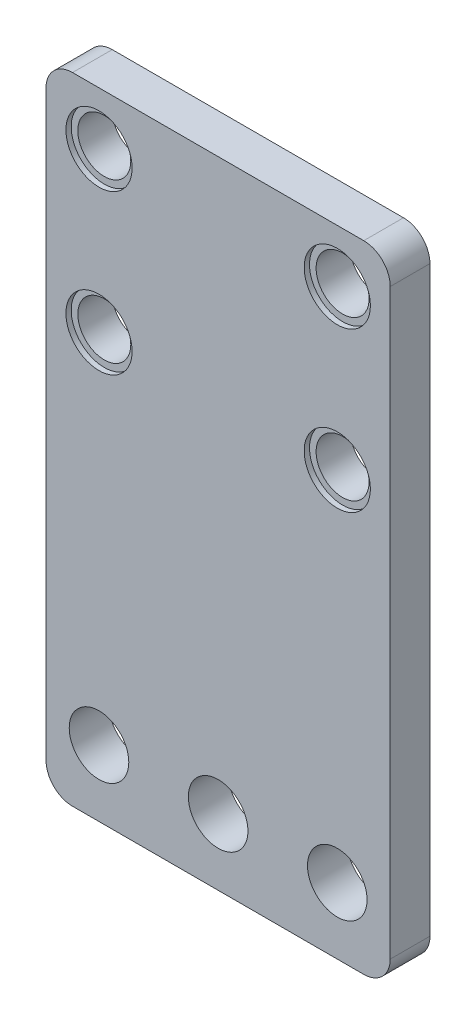
ISO-10303-21;
HEADER;
FILE_DESCRIPTION(('STEP AP214'),'2;1');
FILE_NAME('part.step','',(''),(''),'','','');
FILE_SCHEMA(('AUTOMOTIVE_DESIGN { 1 0 10303 214 1 1 1 1 }'));
ENDSEC;
DATA;
#1=APPLICATION_CONTEXT('core data for automotive mechanical design processes');
#2=APPLICATION_PROTOCOL_DEFINITION('international standard','automotive_design',2000,#1);
#3=PRODUCT_CONTEXT('',#1,'mechanical');
#4=PRODUCT('Part','Part','',(#3));
#5=PRODUCT_RELATED_PRODUCT_CATEGORY('part','',(#4));
#6=PRODUCT_DEFINITION_FORMATION('','',#4);
#7=PRODUCT_DEFINITION_CONTEXT('part definition',#1,'design');
#8=PRODUCT_DEFINITION('design','',#6,#7);
#9=PRODUCT_DEFINITION_SHAPE('','',#8);
#10=(LENGTH_UNIT() NAMED_UNIT(*) SI_UNIT(.MILLI.,.METRE.));
#11=(NAMED_UNIT(*) PLANE_ANGLE_UNIT() SI_UNIT($,.RADIAN.));
#12=(NAMED_UNIT(*) SI_UNIT($,.STERADIAN.) SOLID_ANGLE_UNIT());
#13=UNCERTAINTY_MEASURE_WITH_UNIT(LENGTH_MEASURE(1.E-05),#10,'distance_accuracy_value','');
#14=(GEOMETRIC_REPRESENTATION_CONTEXT(3) GLOBAL_UNCERTAINTY_ASSIGNED_CONTEXT((#13)) GLOBAL_UNIT_ASSIGNED_CONTEXT((#10,
#11,#12)) REPRESENTATION_CONTEXT('',''));
#15=CARTESIAN_POINT('',(0.,0.,0.));
#16=DIRECTION('',(0.,0.,1.));
#17=DIRECTION('',(1.,0.,0.));
#18=AXIS2_PLACEMENT_3D('',#15,#16,#17);
#19=CARTESIAN_POINT('',(4.,44.,0.));
#20=DIRECTION('',(0.,0.,1.));
#21=DIRECTION('',(1.,0.,0.));
#22=AXIS2_PLACEMENT_3D('',#19,#20,#21);
#23=CYLINDRICAL_SURFACE('',#22,2.);
#24=CARTESIAN_POINT('',(4.,44.,0.));
#25=DIRECTION('',(0.,0.,1.));
#26=DIRECTION('',(1.,0.,0.));
#27=AXIS2_PLACEMENT_3D('',#24,#25,#26);
#28=CIRCLE('',#27,2.);
#29=CARTESIAN_POINT('',(6.,44.,0.));
#30=VERTEX_POINT('',#29);
#31=EDGE_CURVE('E126',#30,#30,#28,.T.);
#32=ORIENTED_EDGE('',*,*,#31,.F.);
#33=EDGE_LOOP('',(#32));
#34=FACE_BOUND('',#33,.T.);
#35=CARTESIAN_POINT('',(4.,44.,2.6));
#36=DIRECTION('',(0.,0.,1.));
#37=DIRECTION('',(1.,0.,0.));
#38=AXIS2_PLACEMENT_3D('',#35,#36,#37);
#39=CIRCLE('',#38,2.);
#40=CARTESIAN_POINT('',(6.,44.,2.6));
#41=VERTEX_POINT('',#40);
#42=EDGE_CURVE('E153',#41,#41,#39,.F.);
#43=ORIENTED_EDGE('',*,*,#42,.F.);
#44=EDGE_LOOP('',(#43));
#45=FACE_BOUND('',#44,.T.);
#46=ADVANCED_FACE('F33',(#34,#45),#23,.F.);
#47=CARTESIAN_POINT('',(22.,44.,0.));
#48=DIRECTION('',(0.,0.,1.));
#49=DIRECTION('',(1.,0.,0.));
#50=AXIS2_PLACEMENT_3D('',#47,#48,#49);
#51=CYLINDRICAL_SURFACE('',#50,2.);
#52=CARTESIAN_POINT('',(22.,44.,0.));
#53=DIRECTION('',(0.,0.,1.));
#54=DIRECTION('',(-1.,0.,0.));
#55=AXIS2_PLACEMENT_3D('',#52,#53,#54);
#56=CIRCLE('',#55,2.);
#57=CARTESIAN_POINT('',(20.,44.,0.));
#58=VERTEX_POINT('',#57);
#59=EDGE_CURVE('E195',#58,#58,#56,.T.);
#60=ORIENTED_EDGE('',*,*,#59,.F.);
#61=EDGE_LOOP('',(#60));
#62=FACE_BOUND('',#61,.T.);
#63=CARTESIAN_POINT('',(22.,44.,2.6));
#64=DIRECTION('',(0.,0.,1.));
#65=DIRECTION('',(1.,0.,0.));
#66=AXIS2_PLACEMENT_3D('',#63,#64,#65);
#67=CIRCLE('',#66,2.);
#68=CARTESIAN_POINT('',(24.,44.,2.6));
#69=VERTEX_POINT('',#68);
#70=EDGE_CURVE('E149',#69,#69,#67,.F.);
#71=ORIENTED_EDGE('',*,*,#70,.F.);
#72=EDGE_LOOP('',(#71));
#73=FACE_BOUND('',#72,.T.);
#74=ADVANCED_FACE('F282',(#62,#73),#51,.F.);
#75=CARTESIAN_POINT('',(22.,32.,0.));
#76=DIRECTION('',(0.,0.,1.));
#77=DIRECTION('',(1.,0.,0.));
#78=AXIS2_PLACEMENT_3D('',#75,#76,#77);
#79=CYLINDRICAL_SURFACE('',#78,2.);
#80=CARTESIAN_POINT('',(22.,32.,0.));
#81=DIRECTION('',(0.,0.,1.));
#82=DIRECTION('',(1.,0.,0.));
#83=AXIS2_PLACEMENT_3D('',#80,#81,#82);
#84=CIRCLE('',#83,2.);
#85=CARTESIAN_POINT('',(24.,32.,0.));
#86=VERTEX_POINT('',#85);
#87=EDGE_CURVE('E198',#86,#86,#84,.T.);
#88=ORIENTED_EDGE('',*,*,#87,.F.);
#89=EDGE_LOOP('',(#88));
#90=FACE_BOUND('',#89,.T.);
#91=CARTESIAN_POINT('',(22.,32.,2.6));
#92=DIRECTION('',(0.,0.,1.));
#93=DIRECTION('',(1.,0.,0.));
#94=AXIS2_PLACEMENT_3D('',#91,#92,#93);
#95=CIRCLE('',#94,2.);
#96=CARTESIAN_POINT('',(24.,32.,2.6));
#97=VERTEX_POINT('',#96);
#98=EDGE_CURVE('E146',#97,#97,#95,.F.);
#99=ORIENTED_EDGE('',*,*,#98,.F.);
#100=EDGE_LOOP('',(#99));
#101=FACE_BOUND('',#100,.T.);
#102=ADVANCED_FACE('F288',(#90,#101),#79,.F.);
#103=CARTESIAN_POINT('',(4.,32.,0.));
#104=DIRECTION('',(0.,0.,1.));
#105=DIRECTION('',(1.,0.,0.));
#106=AXIS2_PLACEMENT_3D('',#103,#104,#105);
#107=CYLINDRICAL_SURFACE('',#106,2.);
#108=CARTESIAN_POINT('',(4.,32.,0.));
#109=DIRECTION('',(0.,0.,1.));
#110=DIRECTION('',(-1.,0.,0.));
#111=AXIS2_PLACEMENT_3D('',#108,#109,#110);
#112=CIRCLE('',#111,2.);
#113=CARTESIAN_POINT('',(2.,32.,0.));
#114=VERTEX_POINT('',#113);
#115=EDGE_CURVE('E132',#114,#114,#112,.T.);
#116=ORIENTED_EDGE('',*,*,#115,.F.);
#117=EDGE_LOOP('',(#116));
#118=FACE_BOUND('',#117,.T.);
#119=CARTESIAN_POINT('',(4.,32.,2.6));
#120=DIRECTION('',(0.,0.,1.));
#121=DIRECTION('',(1.,0.,0.));
#122=AXIS2_PLACEMENT_3D('',#119,#120,#121);
#123=CIRCLE('',#122,2.);
#124=CARTESIAN_POINT('',(6.,32.,2.6));
#125=VERTEX_POINT('',#124);
#126=EDGE_CURVE('E141',#125,#125,#123,.F.);
#127=ORIENTED_EDGE('',*,*,#126,.F.);
#128=EDGE_LOOP('',(#127));
#129=FACE_BOUND('',#128,.T.);
#130=ADVANCED_FACE('F306',(#118,#129),#107,.F.);
#131=CARTESIAN_POINT('',(0.,0.,3.));
#132=DIRECTION('',(1.,0.,0.));
#133=DIRECTION('',(0.,0.,-1.));
#134=AXIS2_PLACEMENT_3D('',#131,#132,#133);
#135=PLANE('',#134);
#136=DIRECTION('',(0.,-1.,0.));
#137=VECTOR('',#136,1.);
#138=CARTESIAN_POINT('',(0.,0.,3.));
#139=LINE('',#138,#137);
#140=CARTESIAN_POINT('',(0.,46.,3.));
#141=VERTEX_POINT('',#140);
#142=CARTESIAN_POINT('',(0.,2.,3.));
#143=VERTEX_POINT('',#142);
#144=EDGE_CURVE('E119',#141,#143,#139,.T.);
#145=ORIENTED_EDGE('',*,*,#144,.F.);
#146=DIRECTION('',(0.,0.,-1.));
#147=VECTOR('',#146,1.);
#148=CARTESIAN_POINT('',(0.,46.,3.));
#149=LINE('',#148,#147);
#150=CARTESIAN_POINT('',(0.,46.,0.));
#151=VERTEX_POINT('',#150);
#152=EDGE_CURVE('E103',#141,#151,#149,.T.);
#153=ORIENTED_EDGE('',*,*,#152,.T.);
#154=DIRECTION('',(0.,-1.,0.));
#155=VECTOR('',#154,1.);
#156=CARTESIAN_POINT('',(0.,0.,0.));
#157=LINE('',#156,#155);
#158=CARTESIAN_POINT('',(0.,2.,0.));
#159=VERTEX_POINT('',#158);
#160=EDGE_CURVE('E116',#151,#159,#157,.T.);
#161=ORIENTED_EDGE('',*,*,#160,.T.);
#162=DIRECTION('',(0.,0.,-1.));
#163=VECTOR('',#162,1.);
#164=CARTESIAN_POINT('',(0.,2.,3.));
#165=LINE('',#164,#163);
#166=EDGE_CURVE('E121',#159,#143,#165,.F.);
#167=ORIENTED_EDGE('',*,*,#166,.T.);
#168=EDGE_LOOP('',(#145,#153,#161,#167));
#169=FACE_BOUND('',#168,.T.);
#170=ADVANCED_FACE('F115',(#169),#135,.F.);
#171=CARTESIAN_POINT('',(0.,0.,3.));
#172=DIRECTION('',(0.,1.,0.));
#173=DIRECTION('',(0.,0.,1.));
#174=AXIS2_PLACEMENT_3D('',#171,#172,#173);
#175=PLANE('',#174);
#176=DIRECTION('',(1.,0.,0.));
#177=VECTOR('',#176,1.);
#178=CARTESIAN_POINT('',(0.,0.,0.));
#179=LINE('',#178,#177);
#180=CARTESIAN_POINT('',(2.,0.,0.));
#181=VERTEX_POINT('',#180);
#182=CARTESIAN_POINT('',(24.,0.,0.));
#183=VERTEX_POINT('',#182);
#184=EDGE_CURVE('E125',#181,#183,#179,.T.);
#185=ORIENTED_EDGE('',*,*,#184,.T.);
#186=DIRECTION('',(0.,0.,-1.));
#187=VECTOR('',#186,1.);
#188=CARTESIAN_POINT('',(24.,0.,3.));
#189=LINE('',#188,#187);
#190=CARTESIAN_POINT('',(24.,0.,3.));
#191=VERTEX_POINT('',#190);
#192=EDGE_CURVE('E11',#183,#191,#189,.F.);
#193=ORIENTED_EDGE('',*,*,#192,.T.);
#194=DIRECTION('',(1.,0.,0.));
#195=VECTOR('',#194,1.);
#196=CARTESIAN_POINT('',(0.,0.,3.));
#197=LINE('',#196,#195);
#198=CARTESIAN_POINT('',(2.,0.,3.));
#199=VERTEX_POINT('',#198);
#200=EDGE_CURVE('E181',#199,#191,#197,.T.);
#201=ORIENTED_EDGE('',*,*,#200,.F.);
#202=DIRECTION('',(0.,0.,-1.));
#203=VECTOR('',#202,1.);
#204=CARTESIAN_POINT('',(2.,0.,3.));
#205=LINE('',#204,#203);
#206=EDGE_CURVE('E41',#199,#181,#205,.T.);
#207=ORIENTED_EDGE('',*,*,#206,.T.);
#208=EDGE_LOOP('',(#185,#193,#201,#207));
#209=FACE_BOUND('',#208,.T.);
#210=ADVANCED_FACE('F179',(#209),#175,.F.);
#211=CARTESIAN_POINT('',(26.,0.,3.));
#212=DIRECTION('',(-1.,0.,0.));
#213=DIRECTION('',(0.,0.,1.));
#214=AXIS2_PLACEMENT_3D('',#211,#212,#213);
#215=PLANE('',#214);
#216=DIRECTION('',(0.,1.,0.));
#217=VECTOR('',#216,1.);
#218=CARTESIAN_POINT('',(26.,0.,0.));
#219=LINE('',#218,#217);
#220=CARTESIAN_POINT('',(26.,2.,0.));
#221=VERTEX_POINT('',#220);
#222=CARTESIAN_POINT('',(26.,46.,0.));
#223=VERTEX_POINT('',#222);
#224=EDGE_CURVE('E129',#221,#223,#219,.T.);
#225=ORIENTED_EDGE('',*,*,#224,.T.);
#226=DIRECTION('',(0.,0.,-1.));
#227=VECTOR('',#226,1.);
#228=CARTESIAN_POINT('',(26.,46.,3.));
#229=LINE('',#228,#227);
#230=CARTESIAN_POINT('',(26.,46.,3.));
#231=VERTEX_POINT('',#230);
#232=EDGE_CURVE('E48',#223,#231,#229,.F.);
#233=ORIENTED_EDGE('',*,*,#232,.T.);
#234=DIRECTION('',(0.,1.,0.));
#235=VECTOR('',#234,1.);
#236=CARTESIAN_POINT('',(26.,0.,3.));
#237=LINE('',#236,#235);
#238=CARTESIAN_POINT('',(26.,2.,3.));
#239=VERTEX_POINT('',#238);
#240=EDGE_CURVE('E189',#239,#231,#237,.T.);
#241=ORIENTED_EDGE('',*,*,#240,.F.);
#242=DIRECTION('',(0.,0.,-1.));
#243=VECTOR('',#242,1.);
#244=CARTESIAN_POINT('',(26.,2.,3.));
#245=LINE('',#244,#243);
#246=EDGE_CURVE('E172',#239,#221,#245,.T.);
#247=ORIENTED_EDGE('',*,*,#246,.T.);
#248=EDGE_LOOP('',(#225,#233,#241,#247));
#249=FACE_BOUND('',#248,.T.);
#250=ADVANCED_FACE('F188',(#249),#215,.F.);
#251=CARTESIAN_POINT('',(0.,48.,3.));
#252=DIRECTION('',(0.,-1.,0.));
#253=DIRECTION('',(0.,0.,-1.));
#254=AXIS2_PLACEMENT_3D('',#251,#252,#253);
#255=PLANE('',#254);
#256=DIRECTION('',(-1.,0.,0.));
#257=VECTOR('',#256,1.);
#258=CARTESIAN_POINT('',(0.,48.,0.));
#259=LINE('',#258,#257);
#260=CARTESIAN_POINT('',(24.,48.,0.));
#261=VERTEX_POINT('',#260);
#262=CARTESIAN_POINT('',(2.,48.,0.));
#263=VERTEX_POINT('',#262);
#264=EDGE_CURVE('E139',#261,#263,#259,.T.);
#265=ORIENTED_EDGE('',*,*,#264,.T.);
#266=DIRECTION('',(0.,0.,-1.));
#267=VECTOR('',#266,1.);
#268=CARTESIAN_POINT('',(2.,48.,3.));
#269=LINE('',#268,#267);
#270=CARTESIAN_POINT('',(2.,48.,3.));
#271=VERTEX_POINT('',#270);
#272=EDGE_CURVE('E104',#263,#271,#269,.F.);
#273=ORIENTED_EDGE('',*,*,#272,.T.);
#274=DIRECTION('',(-1.,0.,0.));
#275=VECTOR('',#274,1.);
#276=CARTESIAN_POINT('',(0.,48.,3.));
#277=LINE('',#276,#275);
#278=CARTESIAN_POINT('',(24.,48.,3.));
#279=VERTEX_POINT('',#278);
#280=EDGE_CURVE('E135',#279,#271,#277,.T.);
#281=ORIENTED_EDGE('',*,*,#280,.F.);
#282=DIRECTION('',(0.,0.,-1.));
#283=VECTOR('',#282,1.);
#284=CARTESIAN_POINT('',(24.,48.,3.));
#285=LINE('',#284,#283);
#286=EDGE_CURVE('E109',#279,#261,#285,.T.);
#287=ORIENTED_EDGE('',*,*,#286,.T.);
#288=EDGE_LOOP('',(#265,#273,#281,#287));
#289=FACE_BOUND('',#288,.T.);
#290=ADVANCED_FACE('F255',(#289),#255,.F.);
#291=CARTESIAN_POINT('',(0.,0.,3.));
#292=DIRECTION('',(0.,0.,-1.));
#293=DIRECTION('',(-1.,0.,0.));
#294=AXIS2_PLACEMENT_3D('',#291,#292,#293);
#295=PLANE('',#294);
#296=CARTESIAN_POINT('',(22.,32.,3.));
#297=DIRECTION('',(0.,0.,1.));
#298=DIRECTION('',(1.,0.,0.));
#299=AXIS2_PLACEMENT_3D('',#296,#297,#298);
#300=CIRCLE('',#299,2.5);
#301=CARTESIAN_POINT('',(24.5,32.,3.));
#302=VERTEX_POINT('',#301);
#303=EDGE_CURVE('E236',#302,#302,#300,.T.);
#304=ORIENTED_EDGE('',*,*,#303,.F.);
#305=EDGE_LOOP('',(#304));
#306=FACE_BOUND('',#305,.T.);
#307=CARTESIAN_POINT('',(22.,44.,3.));
#308=DIRECTION('',(0.,0.,1.));
#309=DIRECTION('',(1.,0.,0.));
#310=AXIS2_PLACEMENT_3D('',#307,#308,#309);
#311=CIRCLE('',#310,2.5);
#312=CARTESIAN_POINT('',(24.5,44.,3.));
#313=VERTEX_POINT('',#312);
#314=EDGE_CURVE('E230',#313,#313,#311,.T.);
#315=ORIENTED_EDGE('',*,*,#314,.F.);
#316=EDGE_LOOP('',(#315));
#317=FACE_BOUND('',#316,.T.);
#318=CARTESIAN_POINT('',(4.,44.,3.));
#319=DIRECTION('',(0.,0.,1.));
#320=DIRECTION('',(1.,0.,0.));
#321=AXIS2_PLACEMENT_3D('',#318,#319,#320);
#322=CIRCLE('',#321,2.5);
#323=CARTESIAN_POINT('',(6.5,44.,3.));
#324=VERTEX_POINT('',#323);
#325=EDGE_CURVE('E224',#324,#324,#322,.T.);
#326=ORIENTED_EDGE('',*,*,#325,.F.);
#327=EDGE_LOOP('',(#326));
#328=FACE_BOUND('',#327,.T.);
#329=CARTESIAN_POINT('',(4.,32.,3.));
#330=DIRECTION('',(0.,0.,1.));
#331=DIRECTION('',(1.,0.,0.));
#332=AXIS2_PLACEMENT_3D('',#329,#330,#331);
#333=CIRCLE('',#332,2.5);
#334=CARTESIAN_POINT('',(6.5,32.,3.));
#335=VERTEX_POINT('',#334);
#336=EDGE_CURVE('E156',#335,#335,#333,.T.);
#337=ORIENTED_EDGE('',*,*,#336,.F.);
#338=EDGE_LOOP('',(#337));
#339=FACE_BOUND('',#338,.T.);
#340=CARTESIAN_POINT('',(4.,5.,3.));
#341=DIRECTION('',(0.,0.,-1.));
#342=DIRECTION('',(-1.,0.,0.));
#343=AXIS2_PLACEMENT_3D('',#340,#341,#342);
#344=CIRCLE('',#343,2.25);
#345=CARTESIAN_POINT('',(1.75,5.,3.));
#346=VERTEX_POINT('',#345);
#347=EDGE_CURVE('E209',#346,#346,#344,.T.);
#348=ORIENTED_EDGE('',*,*,#347,.T.);
#349=EDGE_LOOP('',(#348));
#350=FACE_BOUND('',#349,.T.);
#351=CARTESIAN_POINT('',(22.,5.,3.));
#352=DIRECTION('',(0.,0.,-1.));
#353=DIRECTION('',(-1.,0.,0.));
#354=AXIS2_PLACEMENT_3D('',#351,#352,#353);
#355=CIRCLE('',#354,2.25);
#356=CARTESIAN_POINT('',(19.75,5.,3.));
#357=VERTEX_POINT('',#356);
#358=EDGE_CURVE('E212',#357,#357,#355,.T.);
#359=ORIENTED_EDGE('',*,*,#358,.T.);
#360=EDGE_LOOP('',(#359));
#361=FACE_BOUND('',#360,.T.);
#362=CARTESIAN_POINT('',(13.,5.,3.));
#363=DIRECTION('',(0.,0.,-1.));
#364=DIRECTION('',(-1.,0.,0.));
#365=AXIS2_PLACEMENT_3D('',#362,#363,#364);
#366=CIRCLE('',#365,2.25);
#367=CARTESIAN_POINT('',(10.75,5.,3.));
#368=VERTEX_POINT('',#367);
#369=EDGE_CURVE('E199',#368,#368,#366,.T.);
#370=ORIENTED_EDGE('',*,*,#369,.T.);
#371=EDGE_LOOP('',(#370));
#372=FACE_BOUND('',#371,.T.);
#373=ORIENTED_EDGE('',*,*,#280,.T.);
#374=CARTESIAN_POINT('',(2.,46.,3.));
#375=DIRECTION('',(0.,0.,-1.));
#376=DIRECTION('',(-1.,0.,0.));
#377=AXIS2_PLACEMENT_3D('',#374,#375,#376);
#378=CIRCLE('',#377,2.);
#379=EDGE_CURVE('E170',#271,#141,#378,.F.);
#380=ORIENTED_EDGE('',*,*,#379,.T.);
#381=ORIENTED_EDGE('',*,*,#144,.T.);
#382=CARTESIAN_POINT('',(2.,2.,3.));
#383=DIRECTION('',(0.,0.,-1.));
#384=DIRECTION('',(-1.,0.,0.));
#385=AXIS2_PLACEMENT_3D('',#382,#383,#384);
#386=CIRCLE('',#385,2.);
#387=EDGE_CURVE('E165',#143,#199,#386,.F.);
#388=ORIENTED_EDGE('',*,*,#387,.T.);
#389=ORIENTED_EDGE('',*,*,#200,.T.);
#390=CARTESIAN_POINT('',(24.,2.,3.));
#391=DIRECTION('',(0.,0.,-1.));
#392=DIRECTION('',(-1.,0.,0.));
#393=AXIS2_PLACEMENT_3D('',#390,#391,#392);
#394=CIRCLE('',#393,2.);
#395=EDGE_CURVE('E55',#191,#239,#394,.F.);
#396=ORIENTED_EDGE('',*,*,#395,.T.);
#397=ORIENTED_EDGE('',*,*,#240,.T.);
#398=CARTESIAN_POINT('',(24.,46.,3.));
#399=DIRECTION('',(0.,0.,-1.));
#400=DIRECTION('',(-1.,0.,0.));
#401=AXIS2_PLACEMENT_3D('',#398,#399,#400);
#402=CIRCLE('',#401,2.);
#403=EDGE_CURVE('E168',#231,#279,#402,.F.);
#404=ORIENTED_EDGE('',*,*,#403,.T.);
#405=EDGE_LOOP('',(#373,#380,#381,#388,#389,#396,#397,#404));
#406=FACE_BOUND('',#405,.T.);
#407=ADVANCED_FACE('F252',(#306,#317,#328,#339,#350,#361,#372,#406),#295,.F.);
#408=CARTESIAN_POINT('',(0.,0.,0.));
#409=DIRECTION('',(0.,0.,-1.));
#410=DIRECTION('',(-1.,0.,0.));
#411=AXIS2_PLACEMENT_3D('',#408,#409,#410);
#412=PLANE('',#411);
#413=CARTESIAN_POINT('',(4.,5.,0.));
#414=DIRECTION('',(0.,0.,1.));
#415=DIRECTION('',(1.,0.,0.));
#416=AXIS2_PLACEMENT_3D('',#413,#414,#415);
#417=CIRCLE('',#416,2.25);
#418=CARTESIAN_POINT('',(6.25,5.,0.));
#419=VERTEX_POINT('',#418);
#420=EDGE_CURVE('E215',#419,#419,#417,.T.);
#421=ORIENTED_EDGE('',*,*,#420,.T.);
#422=EDGE_LOOP('',(#421));
#423=FACE_BOUND('',#422,.T.);
#424=CARTESIAN_POINT('',(22.,5.,0.));
#425=DIRECTION('',(0.,0.,1.));
#426=DIRECTION('',(-1.,0.,0.));
#427=AXIS2_PLACEMENT_3D('',#424,#425,#426);
#428=CIRCLE('',#427,2.25);
#429=CARTESIAN_POINT('',(19.75,5.,0.));
#430=VERTEX_POINT('',#429);
#431=EDGE_CURVE('E144',#430,#430,#428,.T.);
#432=ORIENTED_EDGE('',*,*,#431,.T.);
#433=EDGE_LOOP('',(#432));
#434=FACE_BOUND('',#433,.T.);
#435=CARTESIAN_POINT('',(13.,5.,0.));
#436=DIRECTION('',(0.,0.,1.));
#437=DIRECTION('',(1.,0.,0.));
#438=AXIS2_PLACEMENT_3D('',#435,#436,#437);
#439=CIRCLE('',#438,2.25);
#440=CARTESIAN_POINT('',(15.25,5.,0.));
#441=VERTEX_POINT('',#440);
#442=EDGE_CURVE('E206',#441,#441,#439,.T.);
#443=ORIENTED_EDGE('',*,*,#442,.T.);
#444=EDGE_LOOP('',(#443));
#445=FACE_BOUND('',#444,.T.);
#446=ORIENTED_EDGE('',*,*,#115,.T.);
#447=EDGE_LOOP('',(#446));
#448=FACE_BOUND('',#447,.T.);
#449=ORIENTED_EDGE('',*,*,#87,.T.);
#450=EDGE_LOOP('',(#449));
#451=FACE_BOUND('',#450,.T.);
#452=ORIENTED_EDGE('',*,*,#59,.T.);
#453=EDGE_LOOP('',(#452));
#454=FACE_BOUND('',#453,.T.);
#455=ORIENTED_EDGE('',*,*,#31,.T.);
#456=EDGE_LOOP('',(#455));
#457=FACE_BOUND('',#456,.T.);
#458=ORIENTED_EDGE('',*,*,#160,.F.);
#459=CARTESIAN_POINT('',(2.,46.,0.));
#460=DIRECTION('',(0.,0.,-1.));
#461=DIRECTION('',(-1.,0.,0.));
#462=AXIS2_PLACEMENT_3D('',#459,#460,#461);
#463=CIRCLE('',#462,2.);
#464=EDGE_CURVE('E99',#151,#263,#463,.T.);
#465=ORIENTED_EDGE('',*,*,#464,.T.);
#466=ORIENTED_EDGE('',*,*,#264,.F.);
#467=CARTESIAN_POINT('',(24.,46.,0.));
#468=DIRECTION('',(0.,0.,-1.));
#469=DIRECTION('',(-1.,0.,0.));
#470=AXIS2_PLACEMENT_3D('',#467,#468,#469);
#471=CIRCLE('',#470,2.);
#472=EDGE_CURVE('E110',#261,#223,#471,.T.);
#473=ORIENTED_EDGE('',*,*,#472,.T.);
#474=ORIENTED_EDGE('',*,*,#224,.F.);
#475=CARTESIAN_POINT('',(24.,2.,0.));
#476=DIRECTION('',(0.,0.,-1.));
#477=DIRECTION('',(-1.,0.,0.));
#478=AXIS2_PLACEMENT_3D('',#475,#476,#477);
#479=CIRCLE('',#478,2.);
#480=EDGE_CURVE('E159',#221,#183,#479,.T.);
#481=ORIENTED_EDGE('',*,*,#480,.T.);
#482=ORIENTED_EDGE('',*,*,#184,.F.);
#483=CARTESIAN_POINT('',(2.,2.,0.));
#484=DIRECTION('',(0.,0.,-1.));
#485=DIRECTION('',(-1.,0.,0.));
#486=AXIS2_PLACEMENT_3D('',#483,#484,#485);
#487=CIRCLE('',#486,2.);
#488=EDGE_CURVE('E120',#181,#159,#487,.T.);
#489=ORIENTED_EDGE('',*,*,#488,.T.);
#490=EDGE_LOOP('',(#458,#465,#466,#473,#474,#481,#482,#489));
#491=FACE_BOUND('',#490,.T.);
#492=ADVANCED_FACE('F123',(#423,#434,#445,#448,#451,#454,#457,#491),#412,.T.);
#493=CARTESIAN_POINT('',(13.,5.,0.));
#494=DIRECTION('',(0.,0.,1.));
#495=DIRECTION('',(1.,0.,0.));
#496=AXIS2_PLACEMENT_3D('',#493,#494,#495);
#497=CYLINDRICAL_SURFACE('',#496,2.25);
#498=ORIENTED_EDGE('',*,*,#442,.F.);
#499=EDGE_LOOP('',(#498));
#500=FACE_BOUND('',#499,.T.);
#501=ORIENTED_EDGE('',*,*,#369,.F.);
#502=EDGE_LOOP('',(#501));
#503=FACE_BOUND('',#502,.T.);
#504=ADVANCED_FACE('F297',(#500,#503),#497,.F.);
#505=CARTESIAN_POINT('',(22.,5.,0.));
#506=DIRECTION('',(0.,0.,1.));
#507=DIRECTION('',(1.,0.,0.));
#508=AXIS2_PLACEMENT_3D('',#505,#506,#507);
#509=CYLINDRICAL_SURFACE('',#508,2.25);
#510=ORIENTED_EDGE('',*,*,#431,.F.);
#511=EDGE_LOOP('',(#510));
#512=FACE_BOUND('',#511,.T.);
#513=ORIENTED_EDGE('',*,*,#358,.F.);
#514=EDGE_LOOP('',(#513));
#515=FACE_BOUND('',#514,.T.);
#516=ADVANCED_FACE('F322',(#512,#515),#509,.F.);
#517=CARTESIAN_POINT('',(4.,5.,0.));
#518=DIRECTION('',(0.,0.,1.));
#519=DIRECTION('',(1.,0.,0.));
#520=AXIS2_PLACEMENT_3D('',#517,#518,#519);
#521=CYLINDRICAL_SURFACE('',#520,2.25);
#522=ORIENTED_EDGE('',*,*,#420,.F.);
#523=EDGE_LOOP('',(#522));
#524=FACE_BOUND('',#523,.T.);
#525=ORIENTED_EDGE('',*,*,#347,.F.);
#526=EDGE_LOOP('',(#525));
#527=FACE_BOUND('',#526,.T.);
#528=ADVANCED_FACE('F326',(#524,#527),#521,.F.);
#529=CARTESIAN_POINT('',(4.,32.,2.6));
#530=DIRECTION('',(0.,0.,1.));
#531=DIRECTION('',(1.,0.,0.));
#532=AXIS2_PLACEMENT_3D('',#529,#530,#531);
#533=PLANE('',#532);
#534=CARTESIAN_POINT('',(4.,32.,2.6));
#535=DIRECTION('',(0.,0.,1.));
#536=DIRECTION('',(1.,0.,0.));
#537=AXIS2_PLACEMENT_3D('',#534,#535,#536);
#538=CIRCLE('',#537,2.5);
#539=CARTESIAN_POINT('',(6.5,32.,2.6));
#540=VERTEX_POINT('',#539);
#541=EDGE_CURVE('E145',#540,#540,#538,.T.);
#542=ORIENTED_EDGE('',*,*,#541,.T.);
#543=EDGE_LOOP('',(#542));
#544=FACE_BOUND('',#543,.T.);
#545=ORIENTED_EDGE('',*,*,#126,.T.);
#546=EDGE_LOOP('',(#545));
#547=FACE_BOUND('',#546,.T.);
#548=ADVANCED_FACE('F330',(#544,#547),#533,.T.);
#549=CARTESIAN_POINT('',(4.,32.,2.6));
#550=DIRECTION('',(0.,0.,1.));
#551=DIRECTION('',(1.,0.,0.));
#552=AXIS2_PLACEMENT_3D('',#549,#550,#551);
#553=CYLINDRICAL_SURFACE('',#552,2.5);
#554=ORIENTED_EDGE('',*,*,#541,.F.);
#555=EDGE_LOOP('',(#554));
#556=FACE_BOUND('',#555,.T.);
#557=ORIENTED_EDGE('',*,*,#336,.T.);
#558=EDGE_LOOP('',(#557));
#559=FACE_BOUND('',#558,.T.);
#560=ADVANCED_FACE('F332',(#556,#559),#553,.F.);
#561=CARTESIAN_POINT('',(22.,32.,2.6));
#562=DIRECTION('',(0.,0.,1.));
#563=DIRECTION('',(1.,0.,0.));
#564=AXIS2_PLACEMENT_3D('',#561,#562,#563);
#565=PLANE('',#564);
#566=CARTESIAN_POINT('',(22.,32.,2.6));
#567=DIRECTION('',(0.,0.,1.));
#568=DIRECTION('',(1.,0.,0.));
#569=AXIS2_PLACEMENT_3D('',#566,#567,#568);
#570=CIRCLE('',#569,2.5);
#571=CARTESIAN_POINT('',(24.5,32.,2.6));
#572=VERTEX_POINT('',#571);
#573=EDGE_CURVE('E150',#572,#572,#570,.T.);
#574=ORIENTED_EDGE('',*,*,#573,.T.);
#575=EDGE_LOOP('',(#574));
#576=FACE_BOUND('',#575,.T.);
#577=ORIENTED_EDGE('',*,*,#98,.T.);
#578=EDGE_LOOP('',(#577));
#579=FACE_BOUND('',#578,.T.);
#580=ADVANCED_FACE('F242',(#576,#579),#565,.T.);
#581=CARTESIAN_POINT('',(22.,32.,2.6));
#582=DIRECTION('',(0.,0.,1.));
#583=DIRECTION('',(1.,0.,0.));
#584=AXIS2_PLACEMENT_3D('',#581,#582,#583);
#585=CYLINDRICAL_SURFACE('',#584,2.5);
#586=ORIENTED_EDGE('',*,*,#573,.F.);
#587=EDGE_LOOP('',(#586));
#588=FACE_BOUND('',#587,.T.);
#589=ORIENTED_EDGE('',*,*,#303,.T.);
#590=EDGE_LOOP('',(#589));
#591=FACE_BOUND('',#590,.T.);
#592=ADVANCED_FACE('F245',(#588,#591),#585,.F.);
#593=CARTESIAN_POINT('',(22.,44.,2.6));
#594=DIRECTION('',(0.,0.,1.));
#595=DIRECTION('',(1.,0.,0.));
#596=AXIS2_PLACEMENT_3D('',#593,#594,#595);
#597=PLANE('',#596);
#598=CARTESIAN_POINT('',(22.,44.,2.6));
#599=DIRECTION('',(0.,0.,1.));
#600=DIRECTION('',(1.,0.,0.));
#601=AXIS2_PLACEMENT_3D('',#598,#599,#600);
#602=CIRCLE('',#601,2.5);
#603=CARTESIAN_POINT('',(24.5,44.,2.6));
#604=VERTEX_POINT('',#603);
#605=EDGE_CURVE('E233',#604,#604,#602,.T.);
#606=ORIENTED_EDGE('',*,*,#605,.T.);
#607=EDGE_LOOP('',(#606));
#608=FACE_BOUND('',#607,.T.);
#609=ORIENTED_EDGE('',*,*,#70,.T.);
#610=EDGE_LOOP('',(#609));
#611=FACE_BOUND('',#610,.T.);
#612=ADVANCED_FACE('F248',(#608,#611),#597,.T.);
#613=CARTESIAN_POINT('',(22.,44.,2.6));
#614=DIRECTION('',(0.,0.,1.));
#615=DIRECTION('',(1.,0.,0.));
#616=AXIS2_PLACEMENT_3D('',#613,#614,#615);
#617=CYLINDRICAL_SURFACE('',#616,2.5);
#618=ORIENTED_EDGE('',*,*,#605,.F.);
#619=EDGE_LOOP('',(#618));
#620=FACE_BOUND('',#619,.T.);
#621=ORIENTED_EDGE('',*,*,#314,.T.);
#622=EDGE_LOOP('',(#621));
#623=FACE_BOUND('',#622,.T.);
#624=ADVANCED_FACE('F345',(#620,#623),#617,.F.);
#625=CARTESIAN_POINT('',(4.,44.,2.6));
#626=DIRECTION('',(0.,0.,1.));
#627=DIRECTION('',(1.,0.,0.));
#628=AXIS2_PLACEMENT_3D('',#625,#626,#627);
#629=PLANE('',#628);
#630=CARTESIAN_POINT('',(4.,44.,2.6));
#631=DIRECTION('',(0.,0.,1.));
#632=DIRECTION('',(1.,0.,0.));
#633=AXIS2_PLACEMENT_3D('',#630,#631,#632);
#634=CIRCLE('',#633,2.5);
#635=CARTESIAN_POINT('',(6.5,44.,2.6));
#636=VERTEX_POINT('',#635);
#637=EDGE_CURVE('E227',#636,#636,#634,.T.);
#638=ORIENTED_EDGE('',*,*,#637,.T.);
#639=EDGE_LOOP('',(#638));
#640=FACE_BOUND('',#639,.T.);
#641=ORIENTED_EDGE('',*,*,#42,.T.);
#642=EDGE_LOOP('',(#641));
#643=FACE_BOUND('',#642,.T.);
#644=ADVANCED_FACE('F341',(#640,#643),#629,.T.);
#645=CARTESIAN_POINT('',(4.,44.,2.6));
#646=DIRECTION('',(0.,0.,1.));
#647=DIRECTION('',(1.,0.,0.));
#648=AXIS2_PLACEMENT_3D('',#645,#646,#647);
#649=CYLINDRICAL_SURFACE('',#648,2.5);
#650=ORIENTED_EDGE('',*,*,#637,.F.);
#651=EDGE_LOOP('',(#650));
#652=FACE_BOUND('',#651,.T.);
#653=ORIENTED_EDGE('',*,*,#325,.T.);
#654=EDGE_LOOP('',(#653));
#655=FACE_BOUND('',#654,.T.);
#656=ADVANCED_FACE('F279',(#652,#655),#649,.F.);
#657=CARTESIAN_POINT('',(2.,46.,3.));
#658=DIRECTION('',(0.,0.,-1.));
#659=DIRECTION('',(-1.,0.,0.));
#660=AXIS2_PLACEMENT_3D('',#657,#658,#659);
#661=CYLINDRICAL_SURFACE('',#660,2.);
#662=ORIENTED_EDGE('',*,*,#379,.F.);
#663=ORIENTED_EDGE('',*,*,#272,.F.);
#664=ORIENTED_EDGE('',*,*,#464,.F.);
#665=ORIENTED_EDGE('',*,*,#152,.F.);
#666=EDGE_LOOP('',(#662,#663,#664,#665));
#667=FACE_BOUND('',#666,.T.);
#668=ADVANCED_FACE('F102',(#667),#661,.T.);
#669=CARTESIAN_POINT('',(24.,46.,3.));
#670=DIRECTION('',(0.,0.,-1.));
#671=DIRECTION('',(-1.,0.,0.));
#672=AXIS2_PLACEMENT_3D('',#669,#670,#671);
#673=CYLINDRICAL_SURFACE('',#672,2.);
#674=ORIENTED_EDGE('',*,*,#403,.F.);
#675=ORIENTED_EDGE('',*,*,#232,.F.);
#676=ORIENTED_EDGE('',*,*,#472,.F.);
#677=ORIENTED_EDGE('',*,*,#286,.F.);
#678=EDGE_LOOP('',(#674,#675,#676,#677));
#679=FACE_BOUND('',#678,.T.);
#680=ADVANCED_FACE('F272',(#679),#673,.T.);
#681=CARTESIAN_POINT('',(24.,2.,3.));
#682=DIRECTION('',(0.,0.,-1.));
#683=DIRECTION('',(-1.,0.,0.));
#684=AXIS2_PLACEMENT_3D('',#681,#682,#683);
#685=CYLINDRICAL_SURFACE('',#684,2.);
#686=ORIENTED_EDGE('',*,*,#395,.F.);
#687=ORIENTED_EDGE('',*,*,#192,.F.);
#688=ORIENTED_EDGE('',*,*,#480,.F.);
#689=ORIENTED_EDGE('',*,*,#246,.F.);
#690=EDGE_LOOP('',(#686,#687,#688,#689));
#691=FACE_BOUND('',#690,.T.);
#692=ADVANCED_FACE('F187',(#691),#685,.T.);
#693=CARTESIAN_POINT('',(2.,2.,3.));
#694=DIRECTION('',(0.,0.,-1.));
#695=DIRECTION('',(-1.,0.,0.));
#696=AXIS2_PLACEMENT_3D('',#693,#694,#695);
#697=CYLINDRICAL_SURFACE('',#696,2.);
#698=ORIENTED_EDGE('',*,*,#387,.F.);
#699=ORIENTED_EDGE('',*,*,#166,.F.);
#700=ORIENTED_EDGE('',*,*,#488,.F.);
#701=ORIENTED_EDGE('',*,*,#206,.F.);
#702=EDGE_LOOP('',(#698,#699,#700,#701));
#703=FACE_BOUND('',#702,.T.);
#704=ADVANCED_FACE('F35',(#703),#697,.T.);
#705=CLOSED_SHELL('',(#46,#74,#102,#130,#170,#210,#250,#290,#407,#492,#504,#516,#528,#548,#560,
#580,#592,#612,#624,#644,#656,#668,#680,#692,#704));
#706=MANIFOLD_SOLID_BREP('B2',#705);
#707=ADVANCED_BREP_SHAPE_REPRESENTATION('',(#18,#706),#14);
#708=SHAPE_DEFINITION_REPRESENTATION(#9,#707);
ENDSEC;
END-ISO-10303-21;
